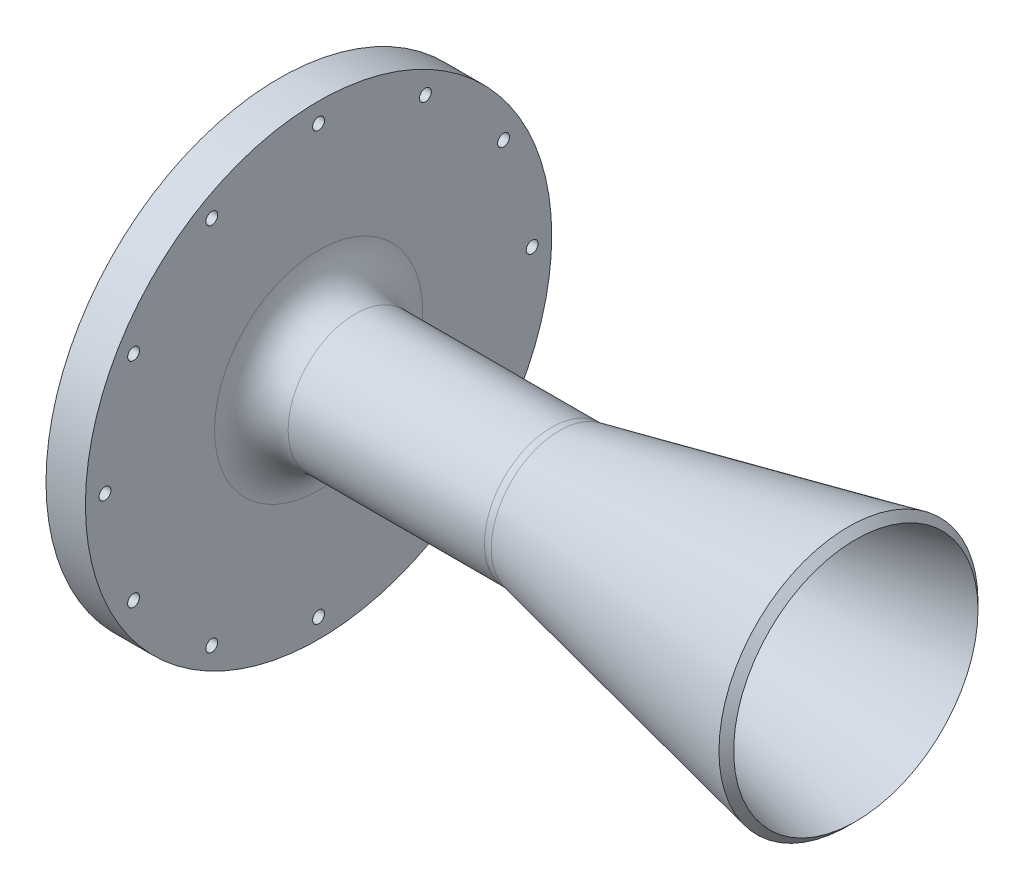
ISO-10303-21;
HEADER;
FILE_DESCRIPTION(('STEP AP214'),'2;1');
FILE_NAME('part.step','',(''),(''),'','','');
FILE_SCHEMA(('AUTOMOTIVE_DESIGN { 1 0 10303 214 1 1 1 1 }'));
ENDSEC;
DATA;
#1=APPLICATION_CONTEXT('core data for automotive mechanical design processes');
#2=APPLICATION_PROTOCOL_DEFINITION('international standard','automotive_design',2000,#1);
#3=PRODUCT_CONTEXT('',#1,'mechanical');
#4=PRODUCT('Part','Part','',(#3));
#5=PRODUCT_RELATED_PRODUCT_CATEGORY('part','',(#4));
#6=PRODUCT_DEFINITION_FORMATION('','',#4);
#7=PRODUCT_DEFINITION_CONTEXT('part definition',#1,'design');
#8=PRODUCT_DEFINITION('design','',#6,#7);
#9=PRODUCT_DEFINITION_SHAPE('','',#8);
#10=(LENGTH_UNIT() NAMED_UNIT(*) SI_UNIT(.MILLI.,.METRE.));
#11=(NAMED_UNIT(*) PLANE_ANGLE_UNIT() SI_UNIT($,.RADIAN.));
#12=(NAMED_UNIT(*) SI_UNIT($,.STERADIAN.) SOLID_ANGLE_UNIT());
#13=UNCERTAINTY_MEASURE_WITH_UNIT(LENGTH_MEASURE(1.E-05),#10,'distance_accuracy_value','');
#14=(GEOMETRIC_REPRESENTATION_CONTEXT(3) GLOBAL_UNCERTAINTY_ASSIGNED_CONTEXT((#13)) GLOBAL_UNIT_ASSIGNED_CONTEXT((#10,
#11,#12)) REPRESENTATION_CONTEXT('',''));
#15=CARTESIAN_POINT('',(0.,0.,0.));
#16=DIRECTION('',(0.,0.,1.));
#17=DIRECTION('',(1.,0.,0.));
#18=AXIS2_PLACEMENT_3D('',#15,#16,#17);
#19=CARTESIAN_POINT('',(0.,20.583496155902,0.));
#20=DIRECTION('',(1.,0.,0.));
#21=DIRECTION('',(0.,0.,-1.));
#22=AXIS2_PLACEMENT_3D('',#19,#20,#21);
#23=PLANE('',#22);
#24=CARTESIAN_POINT('',(0.,0.,0.));
#25=DIRECTION('',(1.,0.,0.));
#26=DIRECTION('',(0.,0.,-1.));
#27=AXIS2_PLACEMENT_3D('',#24,#25,#26);
#28=CIRCLE('',#27,38.1);
#29=CARTESIAN_POINT('',(0.,0.,-38.1));
#30=VERTEX_POINT('',#29);
#31=EDGE_CURVE('E171',#30,#30,#28,.T.);
#32=ORIENTED_EDGE('',*,*,#31,.T.);
#33=EDGE_LOOP('',(#32));
#34=FACE_BOUND('',#33,.T.);
#35=CARTESIAN_POINT('',(0.,-13.3616626129386,49.8664037450867));
#36=DIRECTION('',(-1.,0.,0.));
#37=DIRECTION('',(0.,0.,1.));
#38=AXIS2_PLACEMENT_3D('',#35,#36,#37);
#39=CIRCLE('',#38,2.38125);
#40=CARTESIAN_POINT('',(0.,-13.3616626129386,52.2476537450867));
#41=VERTEX_POINT('',#40);
#42=EDGE_CURVE('E59',#41,#41,#39,.T.);
#43=ORIENTED_EDGE('',*,*,#42,.F.);
#44=EDGE_LOOP('',(#43));
#45=FACE_BOUND('',#44,.T.);
#46=CARTESIAN_POINT('',(0.,13.3616626129382,-49.8664037450868));
#47=DIRECTION('',(-1.,0.,0.));
#48=DIRECTION('',(0.,0.,1.));
#49=AXIS2_PLACEMENT_3D('',#46,#47,#48);
#50=CIRCLE('',#49,2.38125);
#51=CARTESIAN_POINT('',(0.,13.3616626129382,-47.4851537450868));
#52=VERTEX_POINT('',#51);
#53=EDGE_CURVE('E58',#52,#52,#50,.T.);
#54=ORIENTED_EDGE('',*,*,#53,.F.);
#55=EDGE_LOOP('',(#54));
#56=FACE_BOUND('',#55,.T.);
#57=CARTESIAN_POINT('',(0.,-44.7089944830735,-25.81275));
#58=DIRECTION('',(-1.,0.,0.));
#59=DIRECTION('',(0.,0.,1.));
#60=AXIS2_PLACEMENT_3D('',#57,#58,#59);
#61=CIRCLE('',#60,1.43509999999999);
#62=CARTESIAN_POINT('',(0.,-44.7089944830735,-24.37765));
#63=VERTEX_POINT('',#62);
#64=EDGE_CURVE('E77',#63,#63,#61,.T.);
#65=ORIENTED_EDGE('',*,*,#64,.F.);
#66=EDGE_LOOP('',(#65));
#67=FACE_BOUND('',#66,.T.);
#68=CARTESIAN_POINT('',(0.,-25.81275,-44.7089944830735));
#69=DIRECTION('',(-1.,0.,0.));
#70=DIRECTION('',(0.,0.,1.));
#71=AXIS2_PLACEMENT_3D('',#68,#69,#70);
#72=CIRCLE('',#71,1.43509999999999);
#73=CARTESIAN_POINT('',(0.,-25.81275,-43.2738944830735));
#74=VERTEX_POINT('',#73);
#75=EDGE_CURVE('E83',#74,#74,#72,.T.);
#76=ORIENTED_EDGE('',*,*,#75,.F.);
#77=EDGE_LOOP('',(#76));
#78=FACE_BOUND('',#77,.T.);
#79=CARTESIAN_POINT('',(0.,0.,-51.6255));
#80=DIRECTION('',(-1.,0.,0.));
#81=DIRECTION('',(0.,0.,1.));
#82=AXIS2_PLACEMENT_3D('',#79,#80,#81);
#83=CIRCLE('',#82,1.43509999999999);
#84=CARTESIAN_POINT('',(0.,0.,-50.1904));
#85=VERTEX_POINT('',#84);
#86=EDGE_CURVE('E89',#85,#85,#83,.T.);
#87=ORIENTED_EDGE('',*,*,#86,.F.);
#88=EDGE_LOOP('',(#87));
#89=FACE_BOUND('',#88,.T.);
#90=CARTESIAN_POINT('',(0.,25.81275,-44.7089944830735));
#91=DIRECTION('',(-1.,0.,0.));
#92=DIRECTION('',(0.,0.,1.));
#93=AXIS2_PLACEMENT_3D('',#90,#91,#92);
#94=CIRCLE('',#93,1.43509999999999);
#95=CARTESIAN_POINT('',(0.,25.81275,-43.2738944830736));
#96=VERTEX_POINT('',#95);
#97=EDGE_CURVE('E95',#96,#96,#94,.T.);
#98=ORIENTED_EDGE('',*,*,#97,.F.);
#99=EDGE_LOOP('',(#98));
#100=FACE_BOUND('',#99,.T.);
#101=CARTESIAN_POINT('',(0.,44.7089944830735,-25.81275));
#102=DIRECTION('',(-1.,0.,0.));
#103=DIRECTION('',(0.,0.,1.));
#104=AXIS2_PLACEMENT_3D('',#101,#102,#103);
#105=CIRCLE('',#104,1.43509999999999);
#106=CARTESIAN_POINT('',(0.,44.7089944830735,-24.37765));
#107=VERTEX_POINT('',#106);
#108=EDGE_CURVE('E101',#107,#107,#105,.T.);
#109=ORIENTED_EDGE('',*,*,#108,.F.);
#110=EDGE_LOOP('',(#109));
#111=FACE_BOUND('',#110,.T.);
#112=CARTESIAN_POINT('',(0.,51.6255,0.));
#113=DIRECTION('',(-1.,0.,0.));
#114=DIRECTION('',(0.,0.,1.));
#115=AXIS2_PLACEMENT_3D('',#112,#113,#114);
#116=CIRCLE('',#115,1.43509999999999);
#117=CARTESIAN_POINT('',(0.,51.6255,1.43509999999999));
#118=VERTEX_POINT('',#117);
#119=EDGE_CURVE('E107',#118,#118,#116,.T.);
#120=ORIENTED_EDGE('',*,*,#119,.F.);
#121=EDGE_LOOP('',(#120));
#122=FACE_BOUND('',#121,.T.);
#123=CARTESIAN_POINT('',(0.,44.7089944830736,25.81275));
#124=DIRECTION('',(-1.,0.,0.));
#125=DIRECTION('',(0.,0.,1.));
#126=AXIS2_PLACEMENT_3D('',#123,#124,#125);
#127=CIRCLE('',#126,1.43509999999999);
#128=CARTESIAN_POINT('',(0.,44.7089944830736,27.24785));
#129=VERTEX_POINT('',#128);
#130=EDGE_CURVE('E113',#129,#129,#127,.T.);
#131=ORIENTED_EDGE('',*,*,#130,.F.);
#132=EDGE_LOOP('',(#131));
#133=FACE_BOUND('',#132,.T.);
#134=CARTESIAN_POINT('',(0.,25.81275,44.7089944830735));
#135=DIRECTION('',(-1.,0.,0.));
#136=DIRECTION('',(0.,0.,1.));
#137=AXIS2_PLACEMENT_3D('',#134,#135,#136);
#138=CIRCLE('',#137,1.43509999999999);
#139=CARTESIAN_POINT('',(0.,25.81275,46.1440944830735));
#140=VERTEX_POINT('',#139);
#141=EDGE_CURVE('E119',#140,#140,#138,.T.);
#142=ORIENTED_EDGE('',*,*,#141,.F.);
#143=EDGE_LOOP('',(#142));
#144=FACE_BOUND('',#143,.T.);
#145=CARTESIAN_POINT('',(0.,0.,51.6255));
#146=DIRECTION('',(-1.,0.,0.));
#147=DIRECTION('',(0.,0.,1.));
#148=AXIS2_PLACEMENT_3D('',#145,#146,#147);
#149=CIRCLE('',#148,1.43509999999999);
#150=CARTESIAN_POINT('',(0.,0.,53.0606));
#151=VERTEX_POINT('',#150);
#152=EDGE_CURVE('E125',#151,#151,#149,.T.);
#153=ORIENTED_EDGE('',*,*,#152,.F.);
#154=EDGE_LOOP('',(#153));
#155=FACE_BOUND('',#154,.T.);
#156=CARTESIAN_POINT('',(0.,-25.81275,44.7089944830736));
#157=DIRECTION('',(-1.,0.,0.));
#158=DIRECTION('',(0.,0.,1.));
#159=AXIS2_PLACEMENT_3D('',#156,#157,#158);
#160=CIRCLE('',#159,1.43509999999999);
#161=CARTESIAN_POINT('',(0.,-25.81275,46.1440944830736));
#162=VERTEX_POINT('',#161);
#163=EDGE_CURVE('E131',#162,#162,#160,.T.);
#164=ORIENTED_EDGE('',*,*,#163,.F.);
#165=EDGE_LOOP('',(#164));
#166=FACE_BOUND('',#165,.T.);
#167=CARTESIAN_POINT('',(0.,-44.7089944830735,25.81275));
#168=DIRECTION('',(-1.,0.,0.));
#169=DIRECTION('',(0.,0.,1.));
#170=AXIS2_PLACEMENT_3D('',#167,#168,#169);
#171=CIRCLE('',#170,1.43509999999999);
#172=CARTESIAN_POINT('',(0.,-44.7089944830735,27.24785));
#173=VERTEX_POINT('',#172);
#174=EDGE_CURVE('E137',#173,#173,#171,.T.);
#175=ORIENTED_EDGE('',*,*,#174,.F.);
#176=EDGE_LOOP('',(#175));
#177=FACE_BOUND('',#176,.T.);
#178=CARTESIAN_POINT('',(0.,0.,0.));
#179=DIRECTION('',(-1.,0.,0.));
#180=DIRECTION('',(0.,0.,1.));
#181=AXIS2_PLACEMENT_3D('',#178,#179,#180);
#182=CIRCLE('',#181,56.35625);
#183=CARTESIAN_POINT('',(0.,0.,56.35625));
#184=VERTEX_POINT('',#183);
#185=EDGE_CURVE('E146',#184,#184,#182,.T.);
#186=ORIENTED_EDGE('',*,*,#185,.T.);
#187=EDGE_LOOP('',(#186));
#188=FACE_BOUND('',#187,.T.);
#189=CARTESIAN_POINT('',(0.,-51.6255,0.));
#190=DIRECTION('',(-1.,0.,0.));
#191=DIRECTION('',(0.,0.,1.));
#192=AXIS2_PLACEMENT_3D('',#189,#190,#191);
#193=CIRCLE('',#192,1.43509999999999);
#194=CARTESIAN_POINT('',(0.,-51.6255,1.43509999999999));
#195=VERTEX_POINT('',#194);
#196=EDGE_CURVE('E71',#195,#195,#193,.T.);
#197=ORIENTED_EDGE('',*,*,#196,.F.);
#198=EDGE_LOOP('',(#197));
#199=FACE_BOUND('',#198,.T.);
#200=ADVANCED_FACE('F34',(#34,#45,#56,#67,#78,#89,#100,#111,#122,#133,#144,#155,#166,#177,#188,
#199),#23,.F.);
#201=CARTESIAN_POINT('',(60.325,0.,0.));
#202=DIRECTION('',(1.,0.,0.));
#203=DIRECTION('',(0.,0.,-1.));
#204=AXIS2_PLACEMENT_3D('',#201,#202,#203);
#205=CONICAL_SURFACE('',#204,12.7207818181818,0.20943951023932);
#206=CARTESIAN_POINT('',(139.384584692517,0.,0.));
#207=DIRECTION('',(1.,0.,0.));
#208=DIRECTION('',(0.,0.,-1.));
#209=AXIS2_PLACEMENT_3D('',#206,#207,#208);
#210=CIRCLE('',#209,29.5254153074831);
#211=CARTESIAN_POINT('',(139.384584692517,0.,-29.5254153074831));
#212=VERTEX_POINT('',#211);
#213=EDGE_CURVE('E11',#212,#212,#210,.T.);
#214=ORIENTED_EDGE('',*,*,#213,.T.);
#215=EDGE_LOOP('',(#214));
#216=FACE_BOUND('',#215,.T.);
#217=CARTESIAN_POINT('',(60.325,0.,0.));
#218=DIRECTION('',(-1.,0.,0.));
#219=DIRECTION('',(0.,0.,1.));
#220=AXIS2_PLACEMENT_3D('',#217,#218,#219);
#221=CIRCLE('',#220,12.7207818181818);
#222=CARTESIAN_POINT('',(60.325,0.,12.7207818181818));
#223=VERTEX_POINT('',#222);
#224=EDGE_CURVE('E155',#223,#223,#221,.T.);
#225=ORIENTED_EDGE('',*,*,#224,.T.);
#226=EDGE_LOOP('',(#225));
#227=FACE_BOUND('',#226,.T.);
#228=ADVANCED_FACE('F189',(#216,#227),#205,.F.);
#229=CARTESIAN_POINT('',(60.325,12.7207818181818,0.));
#230=DIRECTION('',(1.,0.,0.));
#231=DIRECTION('',(0.,0.,-1.));
#232=AXIS2_PLACEMENT_3D('',#229,#230,#231);
#233=PLANE('',#232);
#234=ORIENTED_EDGE('',*,*,#224,.F.);
#235=EDGE_LOOP('',(#234));
#236=FACE_BOUND('',#235,.T.);
#237=CARTESIAN_POINT('',(60.325,0.,0.));
#238=DIRECTION('',(-1.,0.,0.));
#239=DIRECTION('',(0.,0.,1.));
#240=AXIS2_PLACEMENT_3D('',#237,#238,#239);
#241=CIRCLE('',#240,14.351);
#242=CARTESIAN_POINT('',(60.325,0.,14.351));
#243=VERTEX_POINT('',#242);
#244=EDGE_CURVE('E152',#243,#243,#241,.T.);
#245=ORIENTED_EDGE('',*,*,#244,.T.);
#246=EDGE_LOOP('',(#245));
#247=FACE_BOUND('',#246,.T.);
#248=ADVANCED_FACE('F195',(#236,#247),#233,.F.);
#249=CARTESIAN_POINT('',(0.,0.,0.));
#250=DIRECTION('',(-1.,0.,0.));
#251=DIRECTION('',(0.,0.,1.));
#252=AXIS2_PLACEMENT_3D('',#249,#250,#251);
#253=CYLINDRICAL_SURFACE('',#252,14.351);
#254=ORIENTED_EDGE('',*,*,#244,.F.);
#255=EDGE_LOOP('',(#254));
#256=FACE_BOUND('',#255,.T.);
#257=CARTESIAN_POINT('',(10.795,0.,0.));
#258=DIRECTION('',(-1.,0.,0.));
#259=DIRECTION('',(0.,0.,1.));
#260=AXIS2_PLACEMENT_3D('',#257,#258,#259);
#261=CIRCLE('',#260,14.351);
#262=CARTESIAN_POINT('',(10.795,0.,14.351));
#263=VERTEX_POINT('',#262);
#264=EDGE_CURVE('E149',#263,#263,#261,.T.);
#265=ORIENTED_EDGE('',*,*,#264,.T.);
#266=EDGE_LOOP('',(#265));
#267=FACE_BOUND('',#266,.T.);
#268=ADVANCED_FACE('F207',(#256,#267),#253,.F.);
#269=CARTESIAN_POINT('',(0.,0.,0.));
#270=DIRECTION('',(-1.,0.,0.));
#271=DIRECTION('',(0.,0.,1.));
#272=AXIS2_PLACEMENT_3D('',#269,#270,#271);
#273=CONICAL_SURFACE('',#272,20.583496155902,0.5235987755983);
#274=CARTESIAN_POINT('',(1.61402236879913,0.,0.));
#275=DIRECTION('',(-1.,0.,0.));
#276=DIRECTION('',(0.,0.,1.));
#277=AXIS2_PLACEMENT_3D('',#274,#275,#276);
#278=CIRCLE('',#277,19.6516399067978);
#279=CARTESIAN_POINT('',(1.61402236879913,0.,19.6516399067978));
#280=VERTEX_POINT('',#279);
#281=EDGE_CURVE('E65',#280,#280,#278,.T.);
#282=ORIENTED_EDGE('',*,*,#281,.T.);
#283=EDGE_LOOP('',(#282));
#284=FACE_BOUND('',#283,.T.);
#285=ORIENTED_EDGE('',*,*,#264,.F.);
#286=EDGE_LOOP('',(#285));
#287=FACE_BOUND('',#286,.T.);
#288=ADVANCED_FACE('F204',(#284,#287),#273,.F.);
#289=CARTESIAN_POINT('',(0.,0.,0.));
#290=DIRECTION('',(-1.,0.,0.));
#291=DIRECTION('',(0.,0.,1.));
#292=AXIS2_PLACEMENT_3D('',#289,#290,#291);
#293=CYLINDRICAL_SURFACE('',#292,56.35625);
#294=ORIENTED_EDGE('',*,*,#185,.F.);
#295=EDGE_LOOP('',(#294));
#296=FACE_BOUND('',#295,.T.);
#297=CARTESIAN_POINT('',(9.525,0.,0.));
#298=DIRECTION('',(-1.,0.,0.));
#299=DIRECTION('',(0.,0.,1.));
#300=AXIS2_PLACEMENT_3D('',#297,#298,#299);
#301=CIRCLE('',#300,56.35625);
#302=CARTESIAN_POINT('',(9.525,0.,56.35625));
#303=VERTEX_POINT('',#302);
#304=EDGE_CURVE('E143',#303,#303,#301,.T.);
#305=ORIENTED_EDGE('',*,*,#304,.T.);
#306=EDGE_LOOP('',(#305));
#307=FACE_BOUND('',#306,.T.);
#308=ADVANCED_FACE('F202',(#296,#307),#293,.T.);
#309=CARTESIAN_POINT('',(9.525,56.35625,0.));
#310=DIRECTION('',(-1.,0.,0.));
#311=DIRECTION('',(0.,0.,1.));
#312=AXIS2_PLACEMENT_3D('',#309,#310,#311);
#313=PLANE('',#312);
#314=CARTESIAN_POINT('',(9.525,0.,0.));
#315=DIRECTION('',(-1.,0.,0.));
#316=DIRECTION('',(0.,0.,1.));
#317=AXIS2_PLACEMENT_3D('',#314,#315,#316);
#318=CIRCLE('',#317,25.146);
#319=CARTESIAN_POINT('',(9.525,0.,25.146));
#320=VERTEX_POINT('',#319);
#321=EDGE_CURVE('E158',#320,#320,#318,.T.);
#322=ORIENTED_EDGE('',*,*,#321,.T.);
#323=EDGE_LOOP('',(#322));
#324=FACE_BOUND('',#323,.T.);
#325=CARTESIAN_POINT('',(9.525,-51.6255,0.));
#326=DIRECTION('',(-1.,0.,0.));
#327=DIRECTION('',(0.,0.,1.));
#328=AXIS2_PLACEMENT_3D('',#325,#326,#327);
#329=CIRCLE('',#328,1.43509999999999);
#330=CARTESIAN_POINT('',(9.525,-51.6255,1.43509999999999));
#331=VERTEX_POINT('',#330);
#332=EDGE_CURVE('E74',#331,#331,#329,.T.);
#333=ORIENTED_EDGE('',*,*,#332,.T.);
#334=EDGE_LOOP('',(#333));
#335=FACE_BOUND('',#334,.T.);
#336=CARTESIAN_POINT('',(9.525,-44.7089944830735,-25.81275));
#337=DIRECTION('',(-1.,0.,0.));
#338=DIRECTION('',(0.,0.,1.));
#339=AXIS2_PLACEMENT_3D('',#336,#337,#338);
#340=CIRCLE('',#339,1.43509999999999);
#341=CARTESIAN_POINT('',(9.525,-44.7089944830735,-24.37765));
#342=VERTEX_POINT('',#341);
#343=EDGE_CURVE('E80',#342,#342,#340,.T.);
#344=ORIENTED_EDGE('',*,*,#343,.T.);
#345=EDGE_LOOP('',(#344));
#346=FACE_BOUND('',#345,.T.);
#347=CARTESIAN_POINT('',(9.525,-25.81275,-44.7089944830735));
#348=DIRECTION('',(-1.,0.,0.));
#349=DIRECTION('',(0.,0.,1.));
#350=AXIS2_PLACEMENT_3D('',#347,#348,#349);
#351=CIRCLE('',#350,1.43509999999999);
#352=CARTESIAN_POINT('',(9.525,-25.81275,-43.2738944830735));
#353=VERTEX_POINT('',#352);
#354=EDGE_CURVE('E86',#353,#353,#351,.T.);
#355=ORIENTED_EDGE('',*,*,#354,.T.);
#356=EDGE_LOOP('',(#355));
#357=FACE_BOUND('',#356,.T.);
#358=CARTESIAN_POINT('',(9.525,0.,-51.6255));
#359=DIRECTION('',(-1.,0.,0.));
#360=DIRECTION('',(0.,0.,1.));
#361=AXIS2_PLACEMENT_3D('',#358,#359,#360);
#362=CIRCLE('',#361,1.43509999999999);
#363=CARTESIAN_POINT('',(9.525,0.,-50.1904));
#364=VERTEX_POINT('',#363);
#365=EDGE_CURVE('E92',#364,#364,#362,.T.);
#366=ORIENTED_EDGE('',*,*,#365,.T.);
#367=EDGE_LOOP('',(#366));
#368=FACE_BOUND('',#367,.T.);
#369=CARTESIAN_POINT('',(9.525,25.81275,-44.7089944830735));
#370=DIRECTION('',(-1.,0.,0.));
#371=DIRECTION('',(0.,0.,1.));
#372=AXIS2_PLACEMENT_3D('',#369,#370,#371);
#373=CIRCLE('',#372,1.43509999999999);
#374=CARTESIAN_POINT('',(9.525,25.81275,-43.2738944830736));
#375=VERTEX_POINT('',#374);
#376=EDGE_CURVE('E98',#375,#375,#373,.T.);
#377=ORIENTED_EDGE('',*,*,#376,.T.);
#378=EDGE_LOOP('',(#377));
#379=FACE_BOUND('',#378,.T.);
#380=CARTESIAN_POINT('',(9.525,44.7089944830735,-25.81275));
#381=DIRECTION('',(-1.,0.,0.));
#382=DIRECTION('',(0.,0.,1.));
#383=AXIS2_PLACEMENT_3D('',#380,#381,#382);
#384=CIRCLE('',#383,1.43509999999999);
#385=CARTESIAN_POINT('',(9.525,44.7089944830735,-24.37765));
#386=VERTEX_POINT('',#385);
#387=EDGE_CURVE('E104',#386,#386,#384,.T.);
#388=ORIENTED_EDGE('',*,*,#387,.T.);
#389=EDGE_LOOP('',(#388));
#390=FACE_BOUND('',#389,.T.);
#391=CARTESIAN_POINT('',(9.525,51.6255,0.));
#392=DIRECTION('',(-1.,0.,0.));
#393=DIRECTION('',(0.,0.,1.));
#394=AXIS2_PLACEMENT_3D('',#391,#392,#393);
#395=CIRCLE('',#394,1.43509999999999);
#396=CARTESIAN_POINT('',(9.525,51.6255,1.43509999999999));
#397=VERTEX_POINT('',#396);
#398=EDGE_CURVE('E110',#397,#397,#395,.T.);
#399=ORIENTED_EDGE('',*,*,#398,.T.);
#400=EDGE_LOOP('',(#399));
#401=FACE_BOUND('',#400,.T.);
#402=CARTESIAN_POINT('',(9.525,44.7089944830736,25.81275));
#403=DIRECTION('',(-1.,0.,0.));
#404=DIRECTION('',(0.,0.,1.));
#405=AXIS2_PLACEMENT_3D('',#402,#403,#404);
#406=CIRCLE('',#405,1.43509999999999);
#407=CARTESIAN_POINT('',(9.525,44.7089944830736,27.24785));
#408=VERTEX_POINT('',#407);
#409=EDGE_CURVE('E116',#408,#408,#406,.T.);
#410=ORIENTED_EDGE('',*,*,#409,.T.);
#411=EDGE_LOOP('',(#410));
#412=FACE_BOUND('',#411,.T.);
#413=CARTESIAN_POINT('',(9.525,25.81275,44.7089944830735));
#414=DIRECTION('',(-1.,0.,0.));
#415=DIRECTION('',(0.,0.,1.));
#416=AXIS2_PLACEMENT_3D('',#413,#414,#415);
#417=CIRCLE('',#416,1.43509999999999);
#418=CARTESIAN_POINT('',(9.525,25.81275,46.1440944830735));
#419=VERTEX_POINT('',#418);
#420=EDGE_CURVE('E122',#419,#419,#417,.T.);
#421=ORIENTED_EDGE('',*,*,#420,.T.);
#422=EDGE_LOOP('',(#421));
#423=FACE_BOUND('',#422,.T.);
#424=CARTESIAN_POINT('',(9.525,0.,51.6255));
#425=DIRECTION('',(-1.,0.,0.));
#426=DIRECTION('',(0.,0.,1.));
#427=AXIS2_PLACEMENT_3D('',#424,#425,#426);
#428=CIRCLE('',#427,1.43509999999999);
#429=CARTESIAN_POINT('',(9.525,0.,53.0606));
#430=VERTEX_POINT('',#429);
#431=EDGE_CURVE('E128',#430,#430,#428,.T.);
#432=ORIENTED_EDGE('',*,*,#431,.T.);
#433=EDGE_LOOP('',(#432));
#434=FACE_BOUND('',#433,.T.);
#435=CARTESIAN_POINT('',(9.525,-25.81275,44.7089944830736));
#436=DIRECTION('',(-1.,0.,0.));
#437=DIRECTION('',(0.,0.,1.));
#438=AXIS2_PLACEMENT_3D('',#435,#436,#437);
#439=CIRCLE('',#438,1.43509999999999);
#440=CARTESIAN_POINT('',(9.525,-25.81275,46.1440944830736));
#441=VERTEX_POINT('',#440);
#442=EDGE_CURVE('E134',#441,#441,#439,.T.);
#443=ORIENTED_EDGE('',*,*,#442,.T.);
#444=EDGE_LOOP('',(#443));
#445=FACE_BOUND('',#444,.T.);
#446=CARTESIAN_POINT('',(9.525,-44.7089944830735,25.81275));
#447=DIRECTION('',(-1.,0.,0.));
#448=DIRECTION('',(0.,0.,1.));
#449=AXIS2_PLACEMENT_3D('',#446,#447,#448);
#450=CIRCLE('',#449,1.43509999999999);
#451=CARTESIAN_POINT('',(9.525,-44.7089944830735,27.24785));
#452=VERTEX_POINT('',#451);
#453=EDGE_CURVE('E140',#452,#452,#450,.T.);
#454=ORIENTED_EDGE('',*,*,#453,.T.);
#455=EDGE_LOOP('',(#454));
#456=FACE_BOUND('',#455,.T.);
#457=ORIENTED_EDGE('',*,*,#304,.F.);
#458=EDGE_LOOP('',(#457));
#459=FACE_BOUND('',#458,.T.);
#460=ADVANCED_FACE('F228',(#324,#335,#346,#357,#368,#379,#390,#401,#412,#423,#434,#445,#456,
#459),#313,.F.);
#461=CARTESIAN_POINT('',(0.,0.,0.));
#462=DIRECTION('',(-1.,0.,0.));
#463=DIRECTION('',(0.,0.,1.));
#464=AXIS2_PLACEMENT_3D('',#461,#462,#463);
#465=CYLINDRICAL_SURFACE('',#464,16.256);
#466=CARTESIAN_POINT('',(18.415,0.,0.));
#467=DIRECTION('',(-1.,0.,0.));
#468=DIRECTION('',(0.,0.,1.));
#469=AXIS2_PLACEMENT_3D('',#466,#467,#468);
#470=CIRCLE('',#469,16.256);
#471=CARTESIAN_POINT('',(18.415,0.,16.256));
#472=VERTEX_POINT('',#471);
#473=EDGE_CURVE('E164',#472,#472,#470,.F.);
#474=ORIENTED_EDGE('',*,*,#473,.T.);
#475=EDGE_LOOP('',(#474));
#476=FACE_BOUND('',#475,.T.);
#477=CARTESIAN_POINT('',(65.8720844322291,0.,0.));
#478=DIRECTION('',(-1.,0.,0.));
#479=DIRECTION('',(0.,0.,1.));
#480=AXIS2_PLACEMENT_3D('',#477,#478,#479);
#481=CIRCLE('',#480,16.256);
#482=CARTESIAN_POINT('',(65.8720844322291,0.,16.256));
#483=VERTEX_POINT('',#482);
#484=EDGE_CURVE('E161',#483,#483,#481,.T.);
#485=ORIENTED_EDGE('',*,*,#484,.T.);
#486=EDGE_LOOP('',(#485));
#487=FACE_BOUND('',#486,.T.);
#488=ADVANCED_FACE('F226',(#476,#487),#465,.T.);
#489=CARTESIAN_POINT('',(139.7,0.,0.));
#490=DIRECTION('',(1.,0.,0.));
#491=DIRECTION('',(0.,0.,-1.));
#492=AXIS2_PLACEMENT_3D('',#489,#490,#491);
#493=CONICAL_SURFACE('',#492,31.75,0.20943951023932);
#494=CARTESIAN_POINT('',(137.605252356639,0.,0.));
#495=DIRECTION('',(-1.,0.,0.));
#496=DIRECTION('',(0.,0.,1.));
#497=AXIS2_PLACEMENT_3D('',#494,#495,#496);
#498=CIRCLE('',#497,31.3047476433608);
#499=CARTESIAN_POINT('',(137.605252356639,0.,31.3047476433608));
#500=VERTEX_POINT('',#499);
#501=EDGE_CURVE('E42',#500,#500,#498,.T.);
#502=ORIENTED_EDGE('',*,*,#501,.T.);
#503=EDGE_LOOP('',(#502));
#504=FACE_BOUND('',#503,.T.);
#505=CARTESIAN_POINT('',(67.720419363599,0.,0.));
#506=DIRECTION('',(1.,0.,0.));
#507=DIRECTION('',(0.,0.,-1.));
#508=AXIS2_PLACEMENT_3D('',#505,#506,#507);
#509=CIRCLE('',#508,16.4502678294765);
#510=CARTESIAN_POINT('',(67.720419363599,0.,-16.4502678294765));
#511=VERTEX_POINT('',#510);
#512=EDGE_CURVE('E167',#511,#511,#509,.T.);
#513=ORIENTED_EDGE('',*,*,#512,.T.);
#514=EDGE_LOOP('',(#513));
#515=FACE_BOUND('',#514,.T.);
#516=ADVANCED_FACE('F175',(#504,#515),#493,.T.);
#517=CARTESIAN_POINT('',(0.,-44.7089944830735,25.81275));
#518=DIRECTION('',(-1.,0.,0.));
#519=DIRECTION('',(0.,0.,1.));
#520=AXIS2_PLACEMENT_3D('',#517,#518,#519);
#521=CYLINDRICAL_SURFACE('',#520,1.43509999999999);
#522=ORIENTED_EDGE('',*,*,#453,.F.);
#523=EDGE_LOOP('',(#522));
#524=FACE_BOUND('',#523,.T.);
#525=ORIENTED_EDGE('',*,*,#174,.T.);
#526=EDGE_LOOP('',(#525));
#527=FACE_BOUND('',#526,.T.);
#528=ADVANCED_FACE('F235',(#524,#527),#521,.F.);
#529=CARTESIAN_POINT('',(0.,-25.81275,44.7089944830736));
#530=DIRECTION('',(-1.,0.,0.));
#531=DIRECTION('',(0.,0.,1.));
#532=AXIS2_PLACEMENT_3D('',#529,#530,#531);
#533=CYLINDRICAL_SURFACE('',#532,1.43509999999999);
#534=ORIENTED_EDGE('',*,*,#442,.F.);
#535=EDGE_LOOP('',(#534));
#536=FACE_BOUND('',#535,.T.);
#537=ORIENTED_EDGE('',*,*,#163,.T.);
#538=EDGE_LOOP('',(#537));
#539=FACE_BOUND('',#538,.T.);
#540=ADVANCED_FACE('F241',(#536,#539),#533,.F.);
#541=CARTESIAN_POINT('',(0.,0.,51.6255));
#542=DIRECTION('',(-1.,0.,0.));
#543=DIRECTION('',(0.,0.,1.));
#544=AXIS2_PLACEMENT_3D('',#541,#542,#543);
#545=CYLINDRICAL_SURFACE('',#544,1.43509999999999);
#546=ORIENTED_EDGE('',*,*,#431,.F.);
#547=EDGE_LOOP('',(#546));
#548=FACE_BOUND('',#547,.T.);
#549=ORIENTED_EDGE('',*,*,#152,.T.);
#550=EDGE_LOOP('',(#549));
#551=FACE_BOUND('',#550,.T.);
#552=ADVANCED_FACE('F245',(#548,#551),#545,.F.);
#553=CARTESIAN_POINT('',(0.,25.81275,44.7089944830735));
#554=DIRECTION('',(-1.,0.,0.));
#555=DIRECTION('',(0.,0.,1.));
#556=AXIS2_PLACEMENT_3D('',#553,#554,#555);
#557=CYLINDRICAL_SURFACE('',#556,1.43509999999999);
#558=ORIENTED_EDGE('',*,*,#420,.F.);
#559=EDGE_LOOP('',(#558));
#560=FACE_BOUND('',#559,.T.);
#561=ORIENTED_EDGE('',*,*,#141,.T.);
#562=EDGE_LOOP('',(#561));
#563=FACE_BOUND('',#562,.T.);
#564=ADVANCED_FACE('F249',(#560,#563),#557,.F.);
#565=CARTESIAN_POINT('',(0.,44.7089944830736,25.81275));
#566=DIRECTION('',(-1.,0.,0.));
#567=DIRECTION('',(0.,0.,1.));
#568=AXIS2_PLACEMENT_3D('',#565,#566,#567);
#569=CYLINDRICAL_SURFACE('',#568,1.43509999999999);
#570=ORIENTED_EDGE('',*,*,#409,.F.);
#571=EDGE_LOOP('',(#570));
#572=FACE_BOUND('',#571,.T.);
#573=ORIENTED_EDGE('',*,*,#130,.T.);
#574=EDGE_LOOP('',(#573));
#575=FACE_BOUND('',#574,.T.);
#576=ADVANCED_FACE('F253',(#572,#575),#569,.F.);
#577=CARTESIAN_POINT('',(0.,51.6255,0.));
#578=DIRECTION('',(-1.,0.,0.));
#579=DIRECTION('',(0.,0.,1.));
#580=AXIS2_PLACEMENT_3D('',#577,#578,#579);
#581=CYLINDRICAL_SURFACE('',#580,1.43509999999999);
#582=ORIENTED_EDGE('',*,*,#398,.F.);
#583=EDGE_LOOP('',(#582));
#584=FACE_BOUND('',#583,.T.);
#585=ORIENTED_EDGE('',*,*,#119,.T.);
#586=EDGE_LOOP('',(#585));
#587=FACE_BOUND('',#586,.T.);
#588=ADVANCED_FACE('F257',(#584,#587),#581,.F.);
#589=CARTESIAN_POINT('',(0.,44.7089944830735,-25.81275));
#590=DIRECTION('',(-1.,0.,0.));
#591=DIRECTION('',(0.,0.,1.));
#592=AXIS2_PLACEMENT_3D('',#589,#590,#591);
#593=CYLINDRICAL_SURFACE('',#592,1.43509999999999);
#594=ORIENTED_EDGE('',*,*,#387,.F.);
#595=EDGE_LOOP('',(#594));
#596=FACE_BOUND('',#595,.T.);
#597=ORIENTED_EDGE('',*,*,#108,.T.);
#598=EDGE_LOOP('',(#597));
#599=FACE_BOUND('',#598,.T.);
#600=ADVANCED_FACE('F261',(#596,#599),#593,.F.);
#601=CARTESIAN_POINT('',(0.,25.81275,-44.7089944830735));
#602=DIRECTION('',(-1.,0.,0.));
#603=DIRECTION('',(0.,0.,1.));
#604=AXIS2_PLACEMENT_3D('',#601,#602,#603);
#605=CYLINDRICAL_SURFACE('',#604,1.43509999999999);
#606=ORIENTED_EDGE('',*,*,#376,.F.);
#607=EDGE_LOOP('',(#606));
#608=FACE_BOUND('',#607,.T.);
#609=ORIENTED_EDGE('',*,*,#97,.T.);
#610=EDGE_LOOP('',(#609));
#611=FACE_BOUND('',#610,.T.);
#612=ADVANCED_FACE('F265',(#608,#611),#605,.F.);
#613=CARTESIAN_POINT('',(0.,0.,-51.6255));
#614=DIRECTION('',(-1.,0.,0.));
#615=DIRECTION('',(0.,0.,1.));
#616=AXIS2_PLACEMENT_3D('',#613,#614,#615);
#617=CYLINDRICAL_SURFACE('',#616,1.43509999999999);
#618=ORIENTED_EDGE('',*,*,#365,.F.);
#619=EDGE_LOOP('',(#618));
#620=FACE_BOUND('',#619,.T.);
#621=ORIENTED_EDGE('',*,*,#86,.T.);
#622=EDGE_LOOP('',(#621));
#623=FACE_BOUND('',#622,.T.);
#624=ADVANCED_FACE('F269',(#620,#623),#617,.F.);
#625=CARTESIAN_POINT('',(0.,-25.81275,-44.7089944830735));
#626=DIRECTION('',(-1.,0.,0.));
#627=DIRECTION('',(0.,0.,1.));
#628=AXIS2_PLACEMENT_3D('',#625,#626,#627);
#629=CYLINDRICAL_SURFACE('',#628,1.43509999999999);
#630=ORIENTED_EDGE('',*,*,#354,.F.);
#631=EDGE_LOOP('',(#630));
#632=FACE_BOUND('',#631,.T.);
#633=ORIENTED_EDGE('',*,*,#75,.T.);
#634=EDGE_LOOP('',(#633));
#635=FACE_BOUND('',#634,.T.);
#636=ADVANCED_FACE('F273',(#632,#635),#629,.F.);
#637=CARTESIAN_POINT('',(0.,-44.7089944830735,-25.81275));
#638=DIRECTION('',(-1.,0.,0.));
#639=DIRECTION('',(0.,0.,1.));
#640=AXIS2_PLACEMENT_3D('',#637,#638,#639);
#641=CYLINDRICAL_SURFACE('',#640,1.43509999999999);
#642=ORIENTED_EDGE('',*,*,#343,.F.);
#643=EDGE_LOOP('',(#642));
#644=FACE_BOUND('',#643,.T.);
#645=ORIENTED_EDGE('',*,*,#64,.T.);
#646=EDGE_LOOP('',(#645));
#647=FACE_BOUND('',#646,.T.);
#648=ADVANCED_FACE('F277',(#644,#647),#641,.F.);
#649=CARTESIAN_POINT('',(0.,-51.6255,0.));
#650=DIRECTION('',(-1.,0.,0.));
#651=DIRECTION('',(0.,0.,1.));
#652=AXIS2_PLACEMENT_3D('',#649,#650,#651);
#653=CYLINDRICAL_SURFACE('',#652,1.43509999999999);
#654=ORIENTED_EDGE('',*,*,#332,.F.);
#655=EDGE_LOOP('',(#654));
#656=FACE_BOUND('',#655,.T.);
#657=ORIENTED_EDGE('',*,*,#196,.T.);
#658=EDGE_LOOP('',(#657));
#659=FACE_BOUND('',#658,.T.);
#660=ADVANCED_FACE('F281',(#656,#659),#653,.F.);
#661=CARTESIAN_POINT('',(6.35,13.3616626129382,-49.8664037450868));
#662=DIRECTION('',(-1.,0.,0.));
#663=DIRECTION('',(0.,0.,1.));
#664=AXIS2_PLACEMENT_3D('',#661,#662,#663);
#665=CONICAL_SURFACE('',#664,2.38124999999999,1.02974425867665);
#666=CARTESIAN_POINT('',(7.78079934905938,13.3616626129382,-49.8664037450868));
#667=VERTEX_POINT('',#666);
#668=VERTEX_LOOP('',#667);
#669=FACE_BOUND('',#668,.T.);
#670=CARTESIAN_POINT('',(6.35,13.3616626129382,-49.8664037450868));
#671=DIRECTION('',(-1.,0.,0.));
#672=DIRECTION('',(0.,0.,1.));
#673=AXIS2_PLACEMENT_3D('',#670,#671,#672);
#674=CIRCLE('',#673,2.38124999999999);
#675=CARTESIAN_POINT('',(6.35,13.3616626129382,-47.4851537450868));
#676=VERTEX_POINT('',#675);
#677=EDGE_CURVE('E62',#676,#676,#674,.T.);
#678=ORIENTED_EDGE('',*,*,#677,.T.);
#679=EDGE_LOOP('',(#678));
#680=FACE_BOUND('',#679,.T.);
#681=ADVANCED_FACE('F285',(#669,#680),#665,.F.);
#682=CARTESIAN_POINT('',(0.,13.3616626129382,-49.8664037450868));
#683=DIRECTION('',(-1.,0.,0.));
#684=DIRECTION('',(0.,0.,1.));
#685=AXIS2_PLACEMENT_3D('',#682,#683,#684);
#686=CYLINDRICAL_SURFACE('',#685,2.38125);
#687=ORIENTED_EDGE('',*,*,#677,.F.);
#688=EDGE_LOOP('',(#687));
#689=FACE_BOUND('',#688,.T.);
#690=ORIENTED_EDGE('',*,*,#53,.T.);
#691=EDGE_LOOP('',(#690));
#692=FACE_BOUND('',#691,.T.);
#693=ADVANCED_FACE('F52',(#689,#692),#686,.F.);
#694=CARTESIAN_POINT('',(6.35,-13.3616626129386,49.8664037450867));
#695=DIRECTION('',(-1.,0.,0.));
#696=DIRECTION('',(0.,0.,1.));
#697=AXIS2_PLACEMENT_3D('',#694,#695,#696);
#698=CONICAL_SURFACE('',#697,2.38125,1.02974425867665);
#699=CARTESIAN_POINT('',(7.78079934905938,-13.3616626129386,49.8664037450867));
#700=VERTEX_POINT('',#699);
#701=VERTEX_LOOP('',#700);
#702=FACE_BOUND('',#701,.T.);
#703=CARTESIAN_POINT('',(6.35,-13.3616626129386,49.8664037450867));
#704=DIRECTION('',(-1.,0.,0.));
#705=DIRECTION('',(0.,0.,1.));
#706=AXIS2_PLACEMENT_3D('',#703,#704,#705);
#707=CIRCLE('',#706,2.38125);
#708=CARTESIAN_POINT('',(6.35,-13.3616626129386,52.2476537450867));
#709=VERTEX_POINT('',#708);
#710=EDGE_CURVE('E56',#709,#709,#707,.T.);
#711=ORIENTED_EDGE('',*,*,#710,.T.);
#712=EDGE_LOOP('',(#711));
#713=FACE_BOUND('',#712,.T.);
#714=ADVANCED_FACE('F48',(#702,#713),#698,.F.);
#715=CARTESIAN_POINT('',(0.,-13.3616626129386,49.8664037450867));
#716=DIRECTION('',(-1.,0.,0.));
#717=DIRECTION('',(0.,0.,1.));
#718=AXIS2_PLACEMENT_3D('',#715,#716,#717);
#719=CYLINDRICAL_SURFACE('',#718,2.38125);
#720=ORIENTED_EDGE('',*,*,#710,.F.);
#721=EDGE_LOOP('',(#720));
#722=FACE_BOUND('',#721,.T.);
#723=ORIENTED_EDGE('',*,*,#42,.T.);
#724=EDGE_LOOP('',(#723));
#725=FACE_BOUND('',#724,.T.);
#726=ADVANCED_FACE('F51',(#722,#725),#719,.F.);
#727=CARTESIAN_POINT('',(18.415,0.,0.));
#728=DIRECTION('',(-1.,0.,0.));
#729=DIRECTION('',(0.,0.,1.));
#730=AXIS2_PLACEMENT_3D('',#727,#728,#729);
#731=TOROIDAL_SURFACE('',#730,25.146,8.89);
#732=ORIENTED_EDGE('',*,*,#473,.F.);
#733=EDGE_LOOP('',(#732));
#734=FACE_BOUND('',#733,.T.);
#735=ORIENTED_EDGE('',*,*,#321,.F.);
#736=EDGE_LOOP('',(#735));
#737=FACE_BOUND('',#736,.T.);
#738=ADVANCED_FACE('F215',(#734,#737),#731,.F.);
#739=CARTESIAN_POINT('',(65.8720844322291,0.,0.));
#740=DIRECTION('',(-1.,0.,0.));
#741=DIRECTION('',(0.,0.,1.));
#742=AXIS2_PLACEMENT_3D('',#739,#740,#741);
#743=TOROIDAL_SURFACE('',#742,25.146,8.89);
#744=ORIENTED_EDGE('',*,*,#512,.F.);
#745=EDGE_LOOP('',(#744));
#746=FACE_BOUND('',#745,.T.);
#747=ORIENTED_EDGE('',*,*,#484,.F.);
#748=EDGE_LOOP('',(#747));
#749=FACE_BOUND('',#748,.T.);
#750=ADVANCED_FACE('F184',(#746,#749),#743,.F.);
#751=CARTESIAN_POINT('',(3.33331808033745,0.,0.));
#752=DIRECTION('',(-1.,0.,0.));
#753=DIRECTION('',(0.,0.,1.));
#754=AXIS2_PLACEMENT_3D('',#751,#752,#753);
#755=CONICAL_SURFACE('',#754,0.,1.48352986419519);
#756=ORIENTED_EDGE('',*,*,#31,.F.);
#757=EDGE_LOOP('',(#756));
#758=FACE_BOUND('',#757,.T.);
#759=ORIENTED_EDGE('',*,*,#281,.F.);
#760=EDGE_LOOP('',(#759));
#761=FACE_BOUND('',#760,.T.);
#762=ADVANCED_FACE('F179',(#758,#761),#755,.F.);
#763=CARTESIAN_POINT('',(137.605252356639,0.,0.));
#764=DIRECTION('',(-1.,0.,0.));
#765=DIRECTION('',(0.,0.,1.));
#766=AXIS2_PLACEMENT_3D('',#763,#764,#765);
#767=CONICAL_SURFACE('',#766,31.3047476433608,0.78539816339744);
#768=ORIENTED_EDGE('',*,*,#213,.F.);
#769=EDGE_LOOP('',(#768));
#770=FACE_BOUND('',#769,.T.);
#771=ORIENTED_EDGE('',*,*,#501,.F.);
#772=EDGE_LOOP('',(#771));
#773=FACE_BOUND('',#772,.T.);
#774=ADVANCED_FACE('F36',(#770,#773),#767,.T.);
#775=CLOSED_SHELL('',(#200,#228,#248,#268,#288,#308,#460,#488,#516,#528,#540,#552,#564,#576,
#588,#600,#612,#624,#636,#648,#660,#681,#693,#714,#726,#738,#750,#762,#774));
#776=MANIFOLD_SOLID_BREP('B2',#775);
#777=ADVANCED_BREP_SHAPE_REPRESENTATION('',(#18,#776),#14);
#778=SHAPE_DEFINITION_REPRESENTATION(#9,#777);
ENDSEC;
END-ISO-10303-21;
